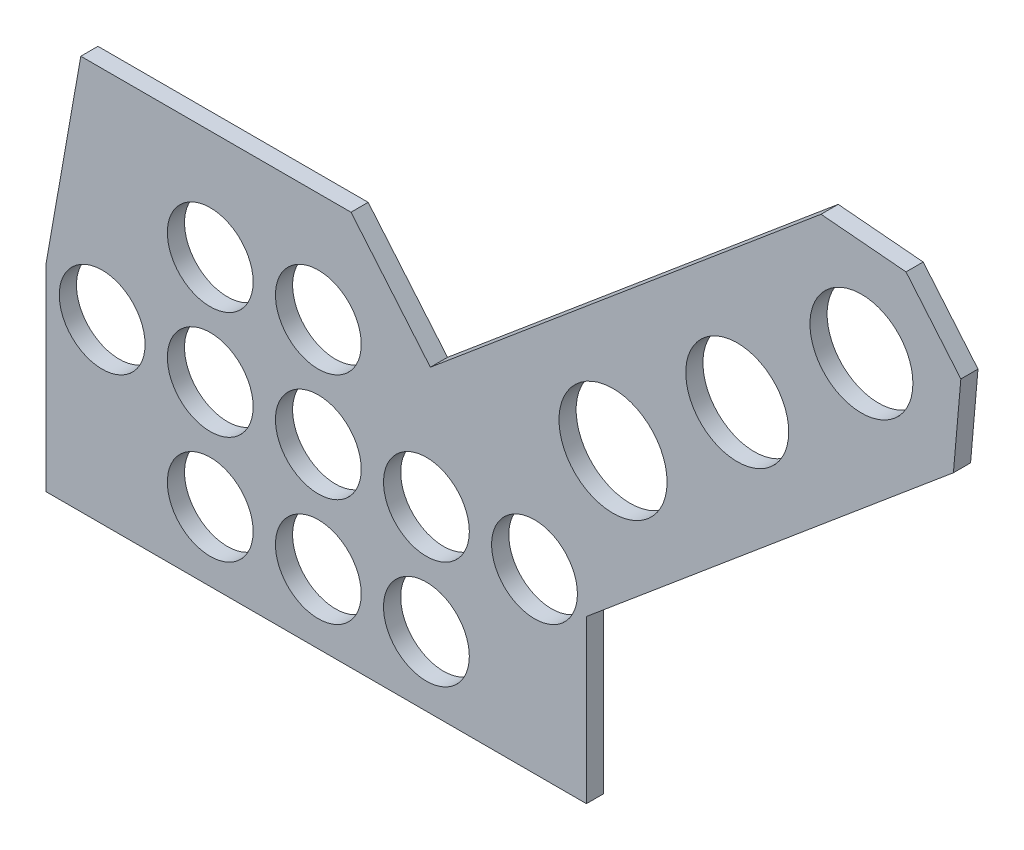
ISO-10303-21;
HEADER;
FILE_DESCRIPTION(('STEP AP214'),'2;1');
FILE_NAME('part.step','',(''),(''),'','','');
FILE_SCHEMA(('AUTOMOTIVE_DESIGN { 1 0 10303 214 1 1 1 1 }'));
ENDSEC;
DATA;
#1=APPLICATION_CONTEXT('core data for automotive mechanical design processes');
#2=APPLICATION_PROTOCOL_DEFINITION('international standard','automotive_design',2000,#1);
#3=PRODUCT_CONTEXT('',#1,'mechanical');
#4=PRODUCT('Part','Part','',(#3));
#5=PRODUCT_RELATED_PRODUCT_CATEGORY('part','',(#4));
#6=PRODUCT_DEFINITION_FORMATION('','',#4);
#7=PRODUCT_DEFINITION_CONTEXT('part definition',#1,'design');
#8=PRODUCT_DEFINITION('design','',#6,#7);
#9=PRODUCT_DEFINITION_SHAPE('','',#8);
#10=(LENGTH_UNIT() NAMED_UNIT(*) SI_UNIT(.MILLI.,.METRE.));
#11=(NAMED_UNIT(*) PLANE_ANGLE_UNIT() SI_UNIT($,.RADIAN.));
#12=(NAMED_UNIT(*) SI_UNIT($,.STERADIAN.) SOLID_ANGLE_UNIT());
#13=UNCERTAINTY_MEASURE_WITH_UNIT(LENGTH_MEASURE(1.E-05),#10,'distance_accuracy_value','');
#14=(GEOMETRIC_REPRESENTATION_CONTEXT(3) GLOBAL_UNCERTAINTY_ASSIGNED_CONTEXT((#13)) GLOBAL_UNIT_ASSIGNED_CONTEXT((#10,
#11,#12)) REPRESENTATION_CONTEXT('',''));
#15=CARTESIAN_POINT('',(0.,0.,0.));
#16=DIRECTION('',(0.,0.,1.));
#17=DIRECTION('',(1.,0.,0.));
#18=AXIS2_PLACEMENT_3D('',#15,#16,#17);
#19=CARTESIAN_POINT('',(56.435934795859,73.,3.175));
#20=DIRECTION('',(0.766044443118981,0.642787609686536,0.));
#21=DIRECTION('',(-0.642787609686536,0.766044443118981,0.));
#22=AXIS2_PLACEMENT_3D('',#19,#20,#21);
#23=PLANE('',#22);
#24=DIRECTION('',(0.642787609686536,-0.766044443118981,0.));
#25=VECTOR('',#24,1.);
#26=CARTESIAN_POINT('',(56.435934795859,73.,0.));
#27=LINE('',#26,#25);
#28=CARTESIAN_POINT('',(56.435934795859,73.,0.));
#29=VERTEX_POINT('',#28);
#30=CARTESIAN_POINT('',(71.1187158914035,55.5017428801103,0.));
#31=VERTEX_POINT('',#30);
#32=EDGE_CURVE('E152',#29,#31,#27,.T.);
#33=ORIENTED_EDGE('',*,*,#32,.F.);
#34=DIRECTION('',(0.,0.,-1.));
#35=VECTOR('',#34,1.);
#36=CARTESIAN_POINT('',(56.435934795859,73.,3.175));
#37=LINE('',#36,#35);
#38=CARTESIAN_POINT('',(56.435934795859,73.,3.175));
#39=VERTEX_POINT('',#38);
#40=EDGE_CURVE('E11',#39,#29,#37,.T.);
#41=ORIENTED_EDGE('',*,*,#40,.F.);
#42=DIRECTION('',(0.642787609686536,-0.766044443118981,0.));
#43=VECTOR('',#42,1.);
#44=CARTESIAN_POINT('',(56.435934795859,73.,3.175));
#45=LINE('',#44,#43);
#46=CARTESIAN_POINT('',(71.1187158914035,55.5017428801103,3.175));
#47=VERTEX_POINT('',#46);
#48=EDGE_CURVE('E175',#39,#47,#45,.T.);
#49=ORIENTED_EDGE('',*,*,#48,.T.);
#50=DIRECTION('',(0.,0.,-1.));
#51=VECTOR('',#50,1.);
#52=CARTESIAN_POINT('',(71.1187158914035,55.5017428801103,3.175));
#53=LINE('',#52,#51);
#54=EDGE_CURVE('E39',#47,#31,#53,.T.);
#55=ORIENTED_EDGE('',*,*,#54,.T.);
#56=EDGE_LOOP('',(#33,#41,#49,#55));
#57=FACE_BOUND('',#56,.T.);
#58=ADVANCED_FACE('F36',(#57),#23,.T.);
#59=CARTESIAN_POINT('',(56.435934795859,73.,3.175));
#60=DIRECTION('',(0.,-1.,0.));
#61=DIRECTION('',(1.,0.,0.));
#62=AXIS2_PLACEMENT_3D('',#59,#60,#61);
#63=PLANE('',#62);
#64=DIRECTION('',(-1.,0.,0.));
#65=VECTOR('',#64,1.);
#66=CARTESIAN_POINT('',(56.435934795859,73.,0.));
#67=LINE('',#66,#65);
#68=CARTESIAN_POINT('',(6.43593479585899,73.,0.));
#69=VERTEX_POINT('',#68);
#70=EDGE_CURVE('E90',#29,#69,#67,.T.);
#71=ORIENTED_EDGE('',*,*,#70,.T.);
#72=DIRECTION('',(0.,0.,-1.));
#73=VECTOR('',#72,1.);
#74=CARTESIAN_POINT('',(6.43593479585899,73.,3.175));
#75=LINE('',#74,#73);
#76=CARTESIAN_POINT('',(6.43593479585899,73.,3.175));
#77=VERTEX_POINT('',#76);
#78=EDGE_CURVE('E45',#77,#69,#75,.T.);
#79=ORIENTED_EDGE('',*,*,#78,.F.);
#80=DIRECTION('',(-1.,0.,0.));
#81=VECTOR('',#80,1.);
#82=CARTESIAN_POINT('',(56.435934795859,73.,3.175));
#83=LINE('',#82,#81);
#84=EDGE_CURVE('E130',#39,#77,#83,.T.);
#85=ORIENTED_EDGE('',*,*,#84,.F.);
#86=ORIENTED_EDGE('',*,*,#40,.T.);
#87=EDGE_LOOP('',(#71,#79,#85,#86));
#88=FACE_BOUND('',#87,.T.);
#89=ADVANCED_FACE('F356',(#88),#63,.F.);
#90=CARTESIAN_POINT('',(6.43593479585899,73.,3.175));
#91=DIRECTION('',(0.984807753012208,-0.173648177666931,0.));
#92=DIRECTION('',(0.173648177666931,0.984807753012208,0.));
#93=AXIS2_PLACEMENT_3D('',#90,#91,#92);
#94=PLANE('',#93);
#95=DIRECTION('',(-0.173648177666931,-0.984807753012208,0.));
#96=VECTOR('',#95,1.);
#97=CARTESIAN_POINT('',(6.43593479585899,73.,0.));
#98=LINE('',#97,#96);
#99=CARTESIAN_POINT('',(0.,36.5,0.));
#100=VERTEX_POINT('',#99);
#101=EDGE_CURVE('E137',#69,#100,#98,.T.);
#102=ORIENTED_EDGE('',*,*,#101,.T.);
#103=DIRECTION('',(0.,0.,-1.));
#104=VECTOR('',#103,1.);
#105=CARTESIAN_POINT('',(0.,36.5,3.175));
#106=LINE('',#105,#104);
#107=CARTESIAN_POINT('',(0.,36.5,3.175));
#108=VERTEX_POINT('',#107);
#109=EDGE_CURVE('E134',#108,#100,#106,.T.);
#110=ORIENTED_EDGE('',*,*,#109,.F.);
#111=DIRECTION('',(-0.173648177666931,-0.984807753012208,0.));
#112=VECTOR('',#111,1.);
#113=CARTESIAN_POINT('',(6.43593479585899,73.,3.175));
#114=LINE('',#113,#112);
#115=EDGE_CURVE('E123',#77,#108,#114,.T.);
#116=ORIENTED_EDGE('',*,*,#115,.F.);
#117=ORIENTED_EDGE('',*,*,#78,.T.);
#118=EDGE_LOOP('',(#102,#110,#116,#117));
#119=FACE_BOUND('',#118,.T.);
#120=ADVANCED_FACE('F135',(#119),#94,.F.);
#121=CARTESIAN_POINT('',(0.,36.5,3.175));
#122=DIRECTION('',(1.,0.,0.));
#123=DIRECTION('',(0.,1.,0.));
#124=AXIS2_PLACEMENT_3D('',#121,#122,#123);
#125=PLANE('',#124);
#126=DIRECTION('',(0.,-1.,0.));
#127=VECTOR('',#126,1.);
#128=CARTESIAN_POINT('',(0.,36.5,0.));
#129=LINE('',#128,#127);
#130=CARTESIAN_POINT('',(0.,0.,0.));
#131=VERTEX_POINT('',#130);
#132=EDGE_CURVE('E172',#100,#131,#129,.T.);
#133=ORIENTED_EDGE('',*,*,#132,.T.);
#134=DIRECTION('',(0.,0.,-1.));
#135=VECTOR('',#134,1.);
#136=CARTESIAN_POINT('',(0.,0.,3.175));
#137=LINE('',#136,#135);
#138=CARTESIAN_POINT('',(0.,0.,3.175));
#139=VERTEX_POINT('',#138);
#140=EDGE_CURVE('E140',#139,#131,#137,.T.);
#141=ORIENTED_EDGE('',*,*,#140,.F.);
#142=DIRECTION('',(0.,-1.,0.));
#143=VECTOR('',#142,1.);
#144=CARTESIAN_POINT('',(0.,36.5,3.175));
#145=LINE('',#144,#143);
#146=EDGE_CURVE('E128',#108,#139,#145,.T.);
#147=ORIENTED_EDGE('',*,*,#146,.F.);
#148=ORIENTED_EDGE('',*,*,#109,.T.);
#149=EDGE_LOOP('',(#133,#141,#147,#148));
#150=FACE_BOUND('',#149,.T.);
#151=ADVANCED_FACE('F142',(#150),#125,.F.);
#152=CARTESIAN_POINT('',(0.,0.,3.175));
#153=DIRECTION('',(0.,1.,0.));
#154=DIRECTION('',(0.,0.,1.));
#155=AXIS2_PLACEMENT_3D('',#152,#153,#154);
#156=PLANE('',#155);
#157=DIRECTION('',(1.,0.,0.));
#158=VECTOR('',#157,1.);
#159=CARTESIAN_POINT('',(0.,0.,0.));
#160=LINE('',#159,#158);
#161=CARTESIAN_POINT('',(100.,0.,0.));
#162=VERTEX_POINT('',#161);
#163=EDGE_CURVE('E170',#131,#162,#160,.T.);
#164=ORIENTED_EDGE('',*,*,#163,.T.);
#165=DIRECTION('',(0.,0.,-1.));
#166=VECTOR('',#165,1.);
#167=CARTESIAN_POINT('',(100.,0.,3.175));
#168=LINE('',#167,#166);
#169=CARTESIAN_POINT('',(100.,0.,3.175));
#170=VERTEX_POINT('',#169);
#171=EDGE_CURVE('E179',#170,#162,#168,.T.);
#172=ORIENTED_EDGE('',*,*,#171,.F.);
#173=DIRECTION('',(1.,0.,0.));
#174=VECTOR('',#173,1.);
#175=CARTESIAN_POINT('',(0.,0.,3.175));
#176=LINE('',#175,#174);
#177=EDGE_CURVE('E145',#139,#170,#176,.T.);
#178=ORIENTED_EDGE('',*,*,#177,.F.);
#179=ORIENTED_EDGE('',*,*,#140,.T.);
#180=EDGE_LOOP('',(#164,#172,#178,#179));
#181=FACE_BOUND('',#180,.T.);
#182=ADVANCED_FACE('F202',(#181),#156,.F.);
#183=CARTESIAN_POINT('',(100.,0.,3.175));
#184=DIRECTION('',(-1.,0.,0.));
#185=DIRECTION('',(0.,-1.,0.));
#186=AXIS2_PLACEMENT_3D('',#183,#184,#185);
#187=PLANE('',#186);
#188=DIRECTION('',(0.,1.,0.));
#189=VECTOR('',#188,1.);
#190=CARTESIAN_POINT('',(100.,0.,0.));
#191=LINE('',#190,#189);
#192=CARTESIAN_POINT('',(100.,30.,0.));
#193=VERTEX_POINT('',#192);
#194=EDGE_CURVE('E168',#162,#193,#191,.T.);
#195=ORIENTED_EDGE('',*,*,#194,.T.);
#196=DIRECTION('',(0.,0.,-1.));
#197=VECTOR('',#196,1.);
#198=CARTESIAN_POINT('',(100.,30.,3.175));
#199=LINE('',#198,#197);
#200=CARTESIAN_POINT('',(100.,30.,3.175));
#201=VERTEX_POINT('',#200);
#202=EDGE_CURVE('E182',#201,#193,#199,.T.);
#203=ORIENTED_EDGE('',*,*,#202,.F.);
#204=DIRECTION('',(0.,1.,0.));
#205=VECTOR('',#204,1.);
#206=CARTESIAN_POINT('',(100.,0.,3.175));
#207=LINE('',#206,#205);
#208=EDGE_CURVE('E147',#170,#201,#207,.T.);
#209=ORIENTED_EDGE('',*,*,#208,.F.);
#210=ORIENTED_EDGE('',*,*,#171,.T.);
#211=EDGE_LOOP('',(#195,#203,#209,#210));
#212=FACE_BOUND('',#211,.T.);
#213=ADVANCED_FACE('F210',(#212),#187,.F.);
#214=CARTESIAN_POINT('',(100.,30.,3.175));
#215=DIRECTION('',(-0.642787609686536,0.76604444311898,0.));
#216=DIRECTION('',(-0.766044443118981,-0.642787609686536,0.));
#217=AXIS2_PLACEMENT_3D('',#214,#215,#216);
#218=PLANE('',#217);
#219=DIRECTION('',(0.766044443118981,0.642787609686536,0.));
#220=VECTOR('',#219,1.);
#221=CARTESIAN_POINT('',(100.,30.,0.));
#222=LINE('',#221,#220);
#223=CARTESIAN_POINT('',(167.901300028348,86.9759558102443,0.));
#224=VERTEX_POINT('',#223);
#225=EDGE_CURVE('E166',#193,#224,#222,.T.);
#226=ORIENTED_EDGE('',*,*,#225,.T.);
#227=DIRECTION('',(0.,0.,-1.));
#228=VECTOR('',#227,1.);
#229=CARTESIAN_POINT('',(167.901300028348,86.9759558102443,3.175));
#230=LINE('',#229,#228);
#231=CARTESIAN_POINT('',(167.901300028348,86.9759558102443,3.175));
#232=VERTEX_POINT('',#231);
#233=EDGE_CURVE('E185',#232,#224,#230,.T.);
#234=ORIENTED_EDGE('',*,*,#233,.F.);
#235=DIRECTION('',(0.766044443118981,0.642787609686536,0.));
#236=VECTOR('',#235,1.);
#237=CARTESIAN_POINT('',(100.,30.,3.175));
#238=LINE('',#237,#236);
#239=EDGE_CURVE('E207',#201,#232,#238,.T.);
#240=ORIENTED_EDGE('',*,*,#239,.F.);
#241=ORIENTED_EDGE('',*,*,#202,.T.);
#242=EDGE_LOOP('',(#226,#234,#240,#241));
#243=FACE_BOUND('',#242,.T.);
#244=ADVANCED_FACE('F213',(#243),#218,.F.);
#245=CARTESIAN_POINT('',(167.901300028348,86.9759558102443,3.175));
#246=DIRECTION('',(-0.996194698091745,0.0871557427476636,0.));
#247=DIRECTION('',(-0.0871557427476636,-0.996194698091745,0.));
#248=AXIS2_PLACEMENT_3D('',#245,#246,#247);
#249=PLANE('',#248);
#250=DIRECTION('',(0.0871557427476636,0.996194698091745,0.));
#251=VECTOR('',#250,1.);
#252=CARTESIAN_POINT('',(167.901300028348,86.9759558102443,0.));
#253=LINE('',#252,#251);
#254=CARTESIAN_POINT('',(169.276751583438,102.697439024839,0.));
#255=VERTEX_POINT('',#254);
#256=EDGE_CURVE('E164',#224,#255,#253,.T.);
#257=ORIENTED_EDGE('',*,*,#256,.T.);
#258=DIRECTION('',(0.,0.,-1.));
#259=VECTOR('',#258,1.);
#260=CARTESIAN_POINT('',(169.276751583438,102.697439024839,3.175));
#261=LINE('',#260,#259);
#262=CARTESIAN_POINT('',(169.276751583438,102.697439024839,3.175));
#263=VERTEX_POINT('',#262);
#264=EDGE_CURVE('E188',#263,#255,#261,.T.);
#265=ORIENTED_EDGE('',*,*,#264,.F.);
#266=DIRECTION('',(0.0871557427476636,0.996194698091745,0.));
#267=VECTOR('',#266,1.);
#268=CARTESIAN_POINT('',(167.901300028348,86.9759558102443,3.175));
#269=LINE('',#268,#267);
#270=EDGE_CURVE('E215',#232,#263,#269,.T.);
#271=ORIENTED_EDGE('',*,*,#270,.F.);
#272=ORIENTED_EDGE('',*,*,#233,.T.);
#273=EDGE_LOOP('',(#257,#265,#271,#272));
#274=FACE_BOUND('',#273,.T.);
#275=ADVANCED_FACE('F374',(#274),#249,.F.);
#276=CARTESIAN_POINT('',(169.276751583438,102.697439024839,3.175));
#277=DIRECTION('',(-0.766044443118978,-0.642787609686539,0.));
#278=DIRECTION('',(0.642787609686539,-0.766044443118978,0.));
#279=AXIS2_PLACEMENT_3D('',#276,#277,#278);
#280=PLANE('',#279);
#281=DIRECTION('',(-0.642787609686539,0.766044443118978,0.));
#282=VECTOR('',#281,1.);
#283=CARTESIAN_POINT('',(169.276751583438,102.697439024839,0.));
#284=LINE('',#283,#282);
#285=CARTESIAN_POINT('',(159.132575313886,114.786797537987,0.));
#286=VERTEX_POINT('',#285);
#287=EDGE_CURVE('E162',#255,#286,#284,.T.);
#288=ORIENTED_EDGE('',*,*,#287,.T.);
#289=DIRECTION('',(0.,0.,-1.));
#290=VECTOR('',#289,1.);
#291=CARTESIAN_POINT('',(159.132575313886,114.786797537987,3.175));
#292=LINE('',#291,#290);
#293=CARTESIAN_POINT('',(159.132575313886,114.786797537987,3.175));
#294=VERTEX_POINT('',#293);
#295=EDGE_CURVE('E191',#294,#286,#292,.T.);
#296=ORIENTED_EDGE('',*,*,#295,.F.);
#297=DIRECTION('',(-0.642787609686539,0.766044443118978,0.));
#298=VECTOR('',#297,1.);
#299=CARTESIAN_POINT('',(169.276751583438,102.697439024839,3.175));
#300=LINE('',#299,#298);
#301=EDGE_CURVE('E217',#263,#294,#300,.T.);
#302=ORIENTED_EDGE('',*,*,#301,.F.);
#303=ORIENTED_EDGE('',*,*,#264,.T.);
#304=EDGE_LOOP('',(#288,#296,#302,#303));
#305=FACE_BOUND('',#304,.T.);
#306=ADVANCED_FACE('F377',(#305),#280,.F.);
#307=CARTESIAN_POINT('',(159.132575313886,114.786797537987,3.175));
#308=DIRECTION('',(-0.0871557427476628,-0.996194698091745,0.));
#309=DIRECTION('',(0.996194698091745,-0.0871557427476628,0.));
#310=AXIS2_PLACEMENT_3D('',#307,#308,#309);
#311=PLANE('',#310);
#312=DIRECTION('',(-0.996194698091745,0.0871557427476628,0.));
#313=VECTOR('',#312,1.);
#314=CARTESIAN_POINT('',(159.132575313886,114.786797537987,0.));
#315=LINE('',#314,#313);
#316=CARTESIAN_POINT('',(143.411092099291,116.162249093077,0.));
#317=VERTEX_POINT('',#316);
#318=EDGE_CURVE('E159',#286,#317,#315,.T.);
#319=ORIENTED_EDGE('',*,*,#318,.T.);
#320=DIRECTION('',(0.,0.,-1.));
#321=VECTOR('',#320,1.);
#322=CARTESIAN_POINT('',(143.411092099291,116.162249093077,3.175));
#323=LINE('',#322,#321);
#324=CARTESIAN_POINT('',(143.411092099291,116.162249093077,3.175));
#325=VERTEX_POINT('',#324);
#326=EDGE_CURVE('E193',#325,#317,#323,.T.);
#327=ORIENTED_EDGE('',*,*,#326,.F.);
#328=DIRECTION('',(-0.996194698091745,0.0871557427476628,0.));
#329=VECTOR('',#328,1.);
#330=CARTESIAN_POINT('',(159.132575313886,114.786797537987,3.175));
#331=LINE('',#330,#329);
#332=EDGE_CURVE('E221',#294,#325,#331,.T.);
#333=ORIENTED_EDGE('',*,*,#332,.F.);
#334=ORIENTED_EDGE('',*,*,#295,.T.);
#335=EDGE_LOOP('',(#319,#327,#333,#334));
#336=FACE_BOUND('',#335,.T.);
#337=ADVANCED_FACE('F381',(#336),#311,.F.);
#338=CARTESIAN_POINT('',(71.1187158914035,55.5017428801103,3.175));
#339=DIRECTION('',(-0.642787609686536,0.766044443118981,0.));
#340=DIRECTION('',(-0.766044443118981,-0.642787609686536,0.));
#341=AXIS2_PLACEMENT_3D('',#338,#339,#340);
#342=PLANE('',#341);
#343=DIRECTION('',(0.766044443118981,0.642787609686536,0.));
#344=VECTOR('',#343,1.);
#345=CARTESIAN_POINT('',(71.1187158914035,55.5017428801103,0.));
#346=LINE('',#345,#344);
#347=EDGE_CURVE('E155',#31,#317,#346,.T.);
#348=ORIENTED_EDGE('',*,*,#347,.F.);
#349=ORIENTED_EDGE('',*,*,#54,.F.);
#350=DIRECTION('',(0.766044443118981,0.642787609686536,0.));
#351=VECTOR('',#350,1.);
#352=CARTESIAN_POINT('',(71.1187158914035,55.5017428801103,3.175));
#353=LINE('',#352,#351);
#354=EDGE_CURVE('E223',#47,#325,#353,.T.);
#355=ORIENTED_EDGE('',*,*,#354,.T.);
#356=ORIENTED_EDGE('',*,*,#326,.T.);
#357=EDGE_LOOP('',(#348,#349,#355,#356));
#358=FACE_BOUND('',#357,.T.);
#359=ADVANCED_FACE('F195',(#358),#342,.T.);
#360=CARTESIAN_POINT('',(0.,0.,3.175));
#361=DIRECTION('',(0.,0.,1.));
#362=DIRECTION('',(1.,0.,0.));
#363=AXIS2_PLACEMENT_3D('',#360,#361,#362);
#364=PLANE('',#363);
#365=CARTESIAN_POINT('',(150.882386677049,97.563400755911,3.175));
#366=DIRECTION('',(0.,0.,1.));
#367=DIRECTION('',(1.,0.,0.));
#368=AXIS2_PLACEMENT_3D('',#365,#366,#367);
#369=CIRCLE('',#368,9.525);
#370=CARTESIAN_POINT('',(160.407386677049,97.563400755911,3.175));
#371=VERTEX_POINT('',#370);
#372=EDGE_CURVE('E275',#371,#371,#369,.T.);
#373=ORIENTED_EDGE('',*,*,#372,.F.);
#374=EDGE_LOOP('',(#373));
#375=FACE_BOUND('',#374,.T.);
#376=CARTESIAN_POINT('',(90.3915081100321,32.7666715774771,3.175));
#377=DIRECTION('',(0.,0.,1.));
#378=DIRECTION('',(1.,0.,0.));
#379=AXIS2_PLACEMENT_3D('',#376,#377,#378);
#380=CIRCLE('',#379,7.93749999999999);
#381=CARTESIAN_POINT('',(98.3290081100321,32.7666715774771,3.175));
#382=VERTEX_POINT('',#381);
#383=EDGE_CURVE('E279',#382,#382,#380,.T.);
#384=ORIENTED_EDGE('',*,*,#383,.F.);
#385=EDGE_LOOP('',(#384));
#386=FACE_BOUND('',#385,.T.);
#387=CARTESIAN_POINT('',(70.3915081100321,12.7666715774771,3.175));
#388=DIRECTION('',(0.,0.,1.));
#389=DIRECTION('',(1.,0.,0.));
#390=AXIS2_PLACEMENT_3D('',#387,#388,#389);
#391=CIRCLE('',#390,7.9375);
#392=CARTESIAN_POINT('',(78.3290081100321,12.7666715774771,3.175));
#393=VERTEX_POINT('',#392);
#394=EDGE_CURVE('E285',#393,#393,#391,.T.);
#395=ORIENTED_EDGE('',*,*,#394,.F.);
#396=EDGE_LOOP('',(#395));
#397=FACE_BOUND('',#396,.T.);
#398=CARTESIAN_POINT('',(50.3915081100321,12.7666715774771,3.175));
#399=DIRECTION('',(0.,0.,1.));
#400=DIRECTION('',(1.,0.,0.));
#401=AXIS2_PLACEMENT_3D('',#398,#399,#400);
#402=CIRCLE('',#401,7.9375);
#403=CARTESIAN_POINT('',(58.3290081100321,12.7666715774771,3.175));
#404=VERTEX_POINT('',#403);
#405=EDGE_CURVE('E291',#404,#404,#402,.T.);
#406=ORIENTED_EDGE('',*,*,#405,.F.);
#407=EDGE_LOOP('',(#406));
#408=FACE_BOUND('',#407,.T.);
#409=CARTESIAN_POINT('',(30.3915081100321,12.7666715774771,3.175));
#410=DIRECTION('',(0.,0.,1.));
#411=DIRECTION('',(1.,0.,0.));
#412=AXIS2_PLACEMENT_3D('',#409,#410,#411);
#413=CIRCLE('',#412,7.93750000000001);
#414=CARTESIAN_POINT('',(38.3290081100321,12.7666715774771,3.175));
#415=VERTEX_POINT('',#414);
#416=EDGE_CURVE('E230',#415,#415,#413,.T.);
#417=ORIENTED_EDGE('',*,*,#416,.F.);
#418=EDGE_LOOP('',(#417));
#419=FACE_BOUND('',#418,.T.);
#420=CARTESIAN_POINT('',(70.3915081100321,32.7666715774771,3.175));
#421=DIRECTION('',(0.,0.,1.));
#422=DIRECTION('',(1.,0.,0.));
#423=AXIS2_PLACEMENT_3D('',#420,#421,#422);
#424=CIRCLE('',#423,7.93749999999999);
#425=CARTESIAN_POINT('',(78.3290081100321,32.7666715774771,3.175));
#426=VERTEX_POINT('',#425);
#427=EDGE_CURVE('E229',#426,#426,#424,.T.);
#428=ORIENTED_EDGE('',*,*,#427,.F.);
#429=EDGE_LOOP('',(#428));
#430=FACE_BOUND('',#429,.T.);
#431=CARTESIAN_POINT('',(50.3915081100321,32.7666715774771,3.175));
#432=DIRECTION('',(0.,0.,1.));
#433=DIRECTION('',(1.,0.,0.));
#434=AXIS2_PLACEMENT_3D('',#431,#432,#433);
#435=CIRCLE('',#434,7.9375);
#436=CARTESIAN_POINT('',(58.3290081100321,32.7666715774771,3.175));
#437=VERTEX_POINT('',#436);
#438=EDGE_CURVE('E236',#437,#437,#435,.T.);
#439=ORIENTED_EDGE('',*,*,#438,.F.);
#440=EDGE_LOOP('',(#439));
#441=FACE_BOUND('',#440,.T.);
#442=CARTESIAN_POINT('',(30.3915081100321,32.7666715774771,3.175));
#443=DIRECTION('',(0.,0.,1.));
#444=DIRECTION('',(1.,0.,0.));
#445=AXIS2_PLACEMENT_3D('',#442,#443,#444);
#446=CIRCLE('',#445,7.93750000000001);
#447=CARTESIAN_POINT('',(38.3290081100321,32.7666715774771,3.175));
#448=VERTEX_POINT('',#447);
#449=EDGE_CURVE('E242',#448,#448,#446,.T.);
#450=ORIENTED_EDGE('',*,*,#449,.F.);
#451=EDGE_LOOP('',(#450));
#452=FACE_BOUND('',#451,.T.);
#453=CARTESIAN_POINT('',(10.3915081100321,32.7666715774771,3.175));
#454=DIRECTION('',(0.,0.,1.));
#455=DIRECTION('',(1.,0.,0.));
#456=AXIS2_PLACEMENT_3D('',#453,#454,#455);
#457=CIRCLE('',#456,7.9375);
#458=CARTESIAN_POINT('',(18.3290081100321,32.7666715774771,3.175));
#459=VERTEX_POINT('',#458);
#460=EDGE_CURVE('E248',#459,#459,#457,.T.);
#461=ORIENTED_EDGE('',*,*,#460,.F.);
#462=EDGE_LOOP('',(#461));
#463=FACE_BOUND('',#462,.T.);
#464=CARTESIAN_POINT('',(50.3915081100321,52.7666715774771,3.175));
#465=DIRECTION('',(0.,0.,1.));
#466=DIRECTION('',(1.,0.,0.));
#467=AXIS2_PLACEMENT_3D('',#464,#465,#466);
#468=CIRCLE('',#467,7.9375);
#469=CARTESIAN_POINT('',(58.3290081100321,52.7666715774771,3.175));
#470=VERTEX_POINT('',#469);
#471=EDGE_CURVE('E254',#470,#470,#468,.T.);
#472=ORIENTED_EDGE('',*,*,#471,.F.);
#473=EDGE_LOOP('',(#472));
#474=FACE_BOUND('',#473,.T.);
#475=CARTESIAN_POINT('',(30.3915081100321,52.7666715774771,3.175));
#476=DIRECTION('',(0.,0.,1.));
#477=DIRECTION('',(1.,0.,0.));
#478=AXIS2_PLACEMENT_3D('',#475,#476,#477);
#479=CIRCLE('',#478,7.93750000000001);
#480=CARTESIAN_POINT('',(38.3290081100321,52.7666715774771,3.175));
#481=VERTEX_POINT('',#480);
#482=EDGE_CURVE('E260',#481,#481,#479,.T.);
#483=ORIENTED_EDGE('',*,*,#482,.F.);
#484=EDGE_LOOP('',(#483));
#485=FACE_BOUND('',#484,.T.);
#486=CARTESIAN_POINT('',(104.91972008991,58.9961441747186,3.175));
#487=DIRECTION('',(0.,0.,1.));
#488=DIRECTION('',(1.,0.,0.));
#489=AXIS2_PLACEMENT_3D('',#486,#487,#488);
#490=CIRCLE('',#489,9.99999999999999);
#491=CARTESIAN_POINT('',(114.91972008991,58.9961441747186,3.175));
#492=VERTEX_POINT('',#491);
#493=EDGE_CURVE('E266',#492,#492,#490,.T.);
#494=ORIENTED_EDGE('',*,*,#493,.F.);
#495=EDGE_LOOP('',(#494));
#496=FACE_BOUND('',#495,.T.);
#497=CARTESIAN_POINT('',(127.90105338348,78.2797724653148,3.175));
#498=DIRECTION('',(0.,0.,1.));
#499=DIRECTION('',(1.,0.,0.));
#500=AXIS2_PLACEMENT_3D('',#497,#498,#499);
#501=CIRCLE('',#500,9.525);
#502=CARTESIAN_POINT('',(137.42605338348,78.2797724653148,3.175));
#503=VERTEX_POINT('',#502);
#504=EDGE_CURVE('E272',#503,#503,#501,.T.);
#505=ORIENTED_EDGE('',*,*,#504,.F.);
#506=EDGE_LOOP('',(#505));
#507=FACE_BOUND('',#506,.T.);
#508=ORIENTED_EDGE('',*,*,#48,.F.);
#509=ORIENTED_EDGE('',*,*,#84,.T.);
#510=ORIENTED_EDGE('',*,*,#115,.T.);
#511=ORIENTED_EDGE('',*,*,#146,.T.);
#512=ORIENTED_EDGE('',*,*,#177,.T.);
#513=ORIENTED_EDGE('',*,*,#208,.T.);
#514=ORIENTED_EDGE('',*,*,#239,.T.);
#515=ORIENTED_EDGE('',*,*,#270,.T.);
#516=ORIENTED_EDGE('',*,*,#301,.T.);
#517=ORIENTED_EDGE('',*,*,#332,.T.);
#518=ORIENTED_EDGE('',*,*,#354,.F.);
#519=EDGE_LOOP('',(#508,#509,#510,#511,#512,#513,#514,#515,#516,#517,#518));
#520=FACE_BOUND('',#519,.T.);
#521=ADVANCED_FACE('F126',(#375,#386,#397,#408,#419,#430,#441,#452,#463,#474,#485,#496,#507,
#520),#364,.T.);
#522=CARTESIAN_POINT('',(0.,0.,0.));
#523=DIRECTION('',(0.,0.,1.));
#524=DIRECTION('',(1.,0.,0.));
#525=AXIS2_PLACEMENT_3D('',#522,#523,#524);
#526=PLANE('',#525);
#527=CARTESIAN_POINT('',(150.882386677049,97.563400755911,0.));
#528=DIRECTION('',(0.,0.,1.));
#529=DIRECTION('',(1.,0.,0.));
#530=AXIS2_PLACEMENT_3D('',#527,#528,#529);
#531=CIRCLE('',#530,9.525);
#532=CARTESIAN_POINT('',(160.407386677049,97.563400755911,0.));
#533=VERTEX_POINT('',#532);
#534=EDGE_CURVE('E156',#533,#533,#531,.T.);
#535=ORIENTED_EDGE('',*,*,#534,.T.);
#536=EDGE_LOOP('',(#535));
#537=FACE_BOUND('',#536,.T.);
#538=CARTESIAN_POINT('',(90.3915081100321,32.7666715774771,0.));
#539=DIRECTION('',(0.,0.,1.));
#540=DIRECTION('',(1.,0.,0.));
#541=AXIS2_PLACEMENT_3D('',#538,#539,#540);
#542=CIRCLE('',#541,7.93749999999999);
#543=CARTESIAN_POINT('',(98.3290081100321,32.7666715774771,0.));
#544=VERTEX_POINT('',#543);
#545=EDGE_CURVE('E276',#544,#544,#542,.T.);
#546=ORIENTED_EDGE('',*,*,#545,.T.);
#547=EDGE_LOOP('',(#546));
#548=FACE_BOUND('',#547,.T.);
#549=CARTESIAN_POINT('',(70.3915081100321,12.7666715774771,0.));
#550=DIRECTION('',(0.,0.,1.));
#551=DIRECTION('',(1.,0.,0.));
#552=AXIS2_PLACEMENT_3D('',#549,#550,#551);
#553=CIRCLE('',#552,7.9375);
#554=CARTESIAN_POINT('',(78.3290081100321,12.7666715774771,0.));
#555=VERTEX_POINT('',#554);
#556=EDGE_CURVE('E282',#555,#555,#553,.T.);
#557=ORIENTED_EDGE('',*,*,#556,.T.);
#558=EDGE_LOOP('',(#557));
#559=FACE_BOUND('',#558,.T.);
#560=CARTESIAN_POINT('',(50.3915081100321,12.7666715774771,0.));
#561=DIRECTION('',(0.,0.,1.));
#562=DIRECTION('',(1.,0.,0.));
#563=AXIS2_PLACEMENT_3D('',#560,#561,#562);
#564=CIRCLE('',#563,7.9375);
#565=CARTESIAN_POINT('',(58.3290081100321,12.7666715774771,0.));
#566=VERTEX_POINT('',#565);
#567=EDGE_CURVE('E288',#566,#566,#564,.T.);
#568=ORIENTED_EDGE('',*,*,#567,.T.);
#569=EDGE_LOOP('',(#568));
#570=FACE_BOUND('',#569,.T.);
#571=CARTESIAN_POINT('',(30.3915081100321,12.7666715774771,0.));
#572=DIRECTION('',(0.,0.,1.));
#573=DIRECTION('',(1.,0.,0.));
#574=AXIS2_PLACEMENT_3D('',#571,#572,#573);
#575=CIRCLE('',#574,7.93750000000001);
#576=CARTESIAN_POINT('',(38.3290081100321,12.7666715774771,0.));
#577=VERTEX_POINT('',#576);
#578=EDGE_CURVE('E294',#577,#577,#575,.T.);
#579=ORIENTED_EDGE('',*,*,#578,.T.);
#580=EDGE_LOOP('',(#579));
#581=FACE_BOUND('',#580,.T.);
#582=CARTESIAN_POINT('',(70.3915081100321,32.7666715774771,0.));
#583=DIRECTION('',(0.,0.,1.));
#584=DIRECTION('',(1.,0.,0.));
#585=AXIS2_PLACEMENT_3D('',#582,#583,#584);
#586=CIRCLE('',#585,7.93749999999999);
#587=CARTESIAN_POINT('',(78.3290081100321,32.7666715774771,0.));
#588=VERTEX_POINT('',#587);
#589=EDGE_CURVE('E226',#588,#588,#586,.T.);
#590=ORIENTED_EDGE('',*,*,#589,.T.);
#591=EDGE_LOOP('',(#590));
#592=FACE_BOUND('',#591,.T.);
#593=CARTESIAN_POINT('',(50.3915081100321,32.7666715774771,0.));
#594=DIRECTION('',(0.,0.,1.));
#595=DIRECTION('',(1.,0.,0.));
#596=AXIS2_PLACEMENT_3D('',#593,#594,#595);
#597=CIRCLE('',#596,7.9375);
#598=CARTESIAN_POINT('',(58.3290081100321,32.7666715774771,0.));
#599=VERTEX_POINT('',#598);
#600=EDGE_CURVE('E233',#599,#599,#597,.T.);
#601=ORIENTED_EDGE('',*,*,#600,.T.);
#602=EDGE_LOOP('',(#601));
#603=FACE_BOUND('',#602,.T.);
#604=CARTESIAN_POINT('',(30.3915081100321,32.7666715774771,0.));
#605=DIRECTION('',(0.,0.,1.));
#606=DIRECTION('',(1.,0.,0.));
#607=AXIS2_PLACEMENT_3D('',#604,#605,#606);
#608=CIRCLE('',#607,7.93750000000001);
#609=CARTESIAN_POINT('',(38.3290081100321,32.7666715774771,0.));
#610=VERTEX_POINT('',#609);
#611=EDGE_CURVE('E239',#610,#610,#608,.T.);
#612=ORIENTED_EDGE('',*,*,#611,.T.);
#613=EDGE_LOOP('',(#612));
#614=FACE_BOUND('',#613,.T.);
#615=CARTESIAN_POINT('',(10.3915081100321,32.7666715774771,0.));
#616=DIRECTION('',(0.,0.,1.));
#617=DIRECTION('',(1.,0.,0.));
#618=AXIS2_PLACEMENT_3D('',#615,#616,#617);
#619=CIRCLE('',#618,7.9375);
#620=CARTESIAN_POINT('',(18.3290081100321,32.7666715774771,0.));
#621=VERTEX_POINT('',#620);
#622=EDGE_CURVE('E245',#621,#621,#619,.T.);
#623=ORIENTED_EDGE('',*,*,#622,.T.);
#624=EDGE_LOOP('',(#623));
#625=FACE_BOUND('',#624,.T.);
#626=CARTESIAN_POINT('',(50.3915081100321,52.7666715774771,0.));
#627=DIRECTION('',(0.,0.,1.));
#628=DIRECTION('',(1.,0.,0.));
#629=AXIS2_PLACEMENT_3D('',#626,#627,#628);
#630=CIRCLE('',#629,7.9375);
#631=CARTESIAN_POINT('',(58.3290081100321,52.7666715774771,0.));
#632=VERTEX_POINT('',#631);
#633=EDGE_CURVE('E251',#632,#632,#630,.T.);
#634=ORIENTED_EDGE('',*,*,#633,.T.);
#635=EDGE_LOOP('',(#634));
#636=FACE_BOUND('',#635,.T.);
#637=CARTESIAN_POINT('',(30.3915081100321,52.7666715774771,0.));
#638=DIRECTION('',(0.,0.,1.));
#639=DIRECTION('',(1.,0.,0.));
#640=AXIS2_PLACEMENT_3D('',#637,#638,#639);
#641=CIRCLE('',#640,7.93750000000001);
#642=CARTESIAN_POINT('',(38.3290081100321,52.7666715774771,0.));
#643=VERTEX_POINT('',#642);
#644=EDGE_CURVE('E257',#643,#643,#641,.T.);
#645=ORIENTED_EDGE('',*,*,#644,.T.);
#646=EDGE_LOOP('',(#645));
#647=FACE_BOUND('',#646,.T.);
#648=CARTESIAN_POINT('',(104.91972008991,58.9961441747186,0.));
#649=DIRECTION('',(0.,0.,1.));
#650=DIRECTION('',(1.,0.,0.));
#651=AXIS2_PLACEMENT_3D('',#648,#649,#650);
#652=CIRCLE('',#651,9.99999999999999);
#653=CARTESIAN_POINT('',(114.91972008991,58.9961441747186,0.));
#654=VERTEX_POINT('',#653);
#655=EDGE_CURVE('E263',#654,#654,#652,.T.);
#656=ORIENTED_EDGE('',*,*,#655,.T.);
#657=EDGE_LOOP('',(#656));
#658=FACE_BOUND('',#657,.T.);
#659=CARTESIAN_POINT('',(127.90105338348,78.2797724653148,0.));
#660=DIRECTION('',(0.,0.,1.));
#661=DIRECTION('',(1.,0.,0.));
#662=AXIS2_PLACEMENT_3D('',#659,#660,#661);
#663=CIRCLE('',#662,9.525);
#664=CARTESIAN_POINT('',(137.42605338348,78.2797724653148,0.));
#665=VERTEX_POINT('',#664);
#666=EDGE_CURVE('E269',#665,#665,#663,.T.);
#667=ORIENTED_EDGE('',*,*,#666,.T.);
#668=EDGE_LOOP('',(#667));
#669=FACE_BOUND('',#668,.T.);
#670=ORIENTED_EDGE('',*,*,#32,.T.);
#671=ORIENTED_EDGE('',*,*,#347,.T.);
#672=ORIENTED_EDGE('',*,*,#318,.F.);
#673=ORIENTED_EDGE('',*,*,#287,.F.);
#674=ORIENTED_EDGE('',*,*,#256,.F.);
#675=ORIENTED_EDGE('',*,*,#225,.F.);
#676=ORIENTED_EDGE('',*,*,#194,.F.);
#677=ORIENTED_EDGE('',*,*,#163,.F.);
#678=ORIENTED_EDGE('',*,*,#132,.F.);
#679=ORIENTED_EDGE('',*,*,#101,.F.);
#680=ORIENTED_EDGE('',*,*,#70,.F.);
#681=EDGE_LOOP('',(#670,#671,#672,#673,#674,#675,#676,#677,#678,#679,#680));
#682=FACE_BOUND('',#681,.T.);
#683=ADVANCED_FACE('F198',(#537,#548,#559,#570,#581,#592,#603,#614,#625,#636,#647,#658,#669,
#682),#526,.F.);
#684=CARTESIAN_POINT('',(127.90105338348,78.2797724653148,0.));
#685=DIRECTION('',(0.,0.,1.));
#686=DIRECTION('',(1.,0.,0.));
#687=AXIS2_PLACEMENT_3D('',#684,#685,#686);
#688=CYLINDRICAL_SURFACE('',#687,9.525);
#689=ORIENTED_EDGE('',*,*,#666,.F.);
#690=EDGE_LOOP('',(#689));
#691=FACE_BOUND('',#690,.T.);
#692=ORIENTED_EDGE('',*,*,#504,.T.);
#693=EDGE_LOOP('',(#692));
#694=FACE_BOUND('',#693,.T.);
#695=ADVANCED_FACE('F340',(#691,#694),#688,.F.);
#696=CARTESIAN_POINT('',(104.91972008991,58.9961441747186,0.));
#697=DIRECTION('',(0.,0.,1.));
#698=DIRECTION('',(1.,0.,0.));
#699=AXIS2_PLACEMENT_3D('',#696,#697,#698);
#700=CYLINDRICAL_SURFACE('',#699,9.99999999999999);
#701=ORIENTED_EDGE('',*,*,#655,.F.);
#702=EDGE_LOOP('',(#701));
#703=FACE_BOUND('',#702,.T.);
#704=ORIENTED_EDGE('',*,*,#493,.T.);
#705=EDGE_LOOP('',(#704));
#706=FACE_BOUND('',#705,.T.);
#707=ADVANCED_FACE('F342',(#703,#706),#700,.F.);
#708=CARTESIAN_POINT('',(30.3915081100321,52.7666715774771,0.));
#709=DIRECTION('',(0.,0.,1.));
#710=DIRECTION('',(1.,0.,0.));
#711=AXIS2_PLACEMENT_3D('',#708,#709,#710);
#712=CYLINDRICAL_SURFACE('',#711,7.93750000000001);
#713=ORIENTED_EDGE('',*,*,#644,.F.);
#714=EDGE_LOOP('',(#713));
#715=FACE_BOUND('',#714,.T.);
#716=ORIENTED_EDGE('',*,*,#482,.T.);
#717=EDGE_LOOP('',(#716));
#718=FACE_BOUND('',#717,.T.);
#719=ADVANCED_FACE('F349',(#715,#718),#712,.F.);
#720=CARTESIAN_POINT('',(50.3915081100321,52.7666715774771,0.));
#721=DIRECTION('',(0.,0.,1.));
#722=DIRECTION('',(1.,0.,0.));
#723=AXIS2_PLACEMENT_3D('',#720,#721,#722);
#724=CYLINDRICAL_SURFACE('',#723,7.9375);
#725=ORIENTED_EDGE('',*,*,#633,.F.);
#726=EDGE_LOOP('',(#725));
#727=FACE_BOUND('',#726,.T.);
#728=ORIENTED_EDGE('',*,*,#471,.T.);
#729=EDGE_LOOP('',(#728));
#730=FACE_BOUND('',#729,.T.);
#731=ADVANCED_FACE('F420',(#727,#730),#724,.F.);
#732=CARTESIAN_POINT('',(10.3915081100321,32.7666715774771,0.));
#733=DIRECTION('',(0.,0.,1.));
#734=DIRECTION('',(1.,0.,0.));
#735=AXIS2_PLACEMENT_3D('',#732,#733,#734);
#736=CYLINDRICAL_SURFACE('',#735,7.9375);
#737=ORIENTED_EDGE('',*,*,#622,.F.);
#738=EDGE_LOOP('',(#737));
#739=FACE_BOUND('',#738,.T.);
#740=ORIENTED_EDGE('',*,*,#460,.T.);
#741=EDGE_LOOP('',(#740));
#742=FACE_BOUND('',#741,.T.);
#743=ADVANCED_FACE('F431',(#739,#742),#736,.F.);
#744=CARTESIAN_POINT('',(30.3915081100321,32.7666715774771,0.));
#745=DIRECTION('',(0.,0.,1.));
#746=DIRECTION('',(1.,0.,0.));
#747=AXIS2_PLACEMENT_3D('',#744,#745,#746);
#748=CYLINDRICAL_SURFACE('',#747,7.93750000000001);
#749=ORIENTED_EDGE('',*,*,#611,.F.);
#750=EDGE_LOOP('',(#749));
#751=FACE_BOUND('',#750,.T.);
#752=ORIENTED_EDGE('',*,*,#449,.T.);
#753=EDGE_LOOP('',(#752));
#754=FACE_BOUND('',#753,.T.);
#755=ADVANCED_FACE('F442',(#751,#754),#748,.F.);
#756=CARTESIAN_POINT('',(50.3915081100321,32.7666715774771,0.));
#757=DIRECTION('',(0.,0.,1.));
#758=DIRECTION('',(1.,0.,0.));
#759=AXIS2_PLACEMENT_3D('',#756,#757,#758);
#760=CYLINDRICAL_SURFACE('',#759,7.9375);
#761=ORIENTED_EDGE('',*,*,#600,.F.);
#762=EDGE_LOOP('',(#761));
#763=FACE_BOUND('',#762,.T.);
#764=ORIENTED_EDGE('',*,*,#438,.T.);
#765=EDGE_LOOP('',(#764));
#766=FACE_BOUND('',#765,.T.);
#767=ADVANCED_FACE('F453',(#763,#766),#760,.F.);
#768=CARTESIAN_POINT('',(70.3915081100321,32.7666715774771,0.));
#769=DIRECTION('',(0.,0.,1.));
#770=DIRECTION('',(1.,0.,0.));
#771=AXIS2_PLACEMENT_3D('',#768,#769,#770);
#772=CYLINDRICAL_SURFACE('',#771,7.93749999999999);
#773=ORIENTED_EDGE('',*,*,#589,.F.);
#774=EDGE_LOOP('',(#773));
#775=FACE_BOUND('',#774,.T.);
#776=ORIENTED_EDGE('',*,*,#427,.T.);
#777=EDGE_LOOP('',(#776));
#778=FACE_BOUND('',#777,.T.);
#779=ADVANCED_FACE('F464',(#775,#778),#772,.F.);
#780=CARTESIAN_POINT('',(30.3915081100321,12.7666715774771,0.));
#781=DIRECTION('',(0.,0.,1.));
#782=DIRECTION('',(1.,0.,0.));
#783=AXIS2_PLACEMENT_3D('',#780,#781,#782);
#784=CYLINDRICAL_SURFACE('',#783,7.93750000000001);
#785=ORIENTED_EDGE('',*,*,#578,.F.);
#786=EDGE_LOOP('',(#785));
#787=FACE_BOUND('',#786,.T.);
#788=ORIENTED_EDGE('',*,*,#416,.T.);
#789=EDGE_LOOP('',(#788));
#790=FACE_BOUND('',#789,.T.);
#791=ADVANCED_FACE('F475',(#787,#790),#784,.F.);
#792=CARTESIAN_POINT('',(50.3915081100321,12.7666715774771,0.));
#793=DIRECTION('',(0.,0.,1.));
#794=DIRECTION('',(1.,0.,0.));
#795=AXIS2_PLACEMENT_3D('',#792,#793,#794);
#796=CYLINDRICAL_SURFACE('',#795,7.9375);
#797=ORIENTED_EDGE('',*,*,#567,.F.);
#798=EDGE_LOOP('',(#797));
#799=FACE_BOUND('',#798,.T.);
#800=ORIENTED_EDGE('',*,*,#405,.T.);
#801=EDGE_LOOP('',(#800));
#802=FACE_BOUND('',#801,.T.);
#803=ADVANCED_FACE('F486',(#799,#802),#796,.F.);
#804=CARTESIAN_POINT('',(70.3915081100321,12.7666715774771,0.));
#805=DIRECTION('',(0.,0.,1.));
#806=DIRECTION('',(1.,0.,0.));
#807=AXIS2_PLACEMENT_3D('',#804,#805,#806);
#808=CYLINDRICAL_SURFACE('',#807,7.9375);
#809=ORIENTED_EDGE('',*,*,#556,.F.);
#810=EDGE_LOOP('',(#809));
#811=FACE_BOUND('',#810,.T.);
#812=ORIENTED_EDGE('',*,*,#394,.T.);
#813=EDGE_LOOP('',(#812));
#814=FACE_BOUND('',#813,.T.);
#815=ADVANCED_FACE('F497',(#811,#814),#808,.F.);
#816=CARTESIAN_POINT('',(90.3915081100321,32.7666715774771,0.));
#817=DIRECTION('',(0.,0.,1.));
#818=DIRECTION('',(1.,0.,0.));
#819=AXIS2_PLACEMENT_3D('',#816,#817,#818);
#820=CYLINDRICAL_SURFACE('',#819,7.93749999999999);
#821=ORIENTED_EDGE('',*,*,#545,.F.);
#822=EDGE_LOOP('',(#821));
#823=FACE_BOUND('',#822,.T.);
#824=ORIENTED_EDGE('',*,*,#383,.T.);
#825=EDGE_LOOP('',(#824));
#826=FACE_BOUND('',#825,.T.);
#827=ADVANCED_FACE('F309',(#823,#826),#820,.F.);
#828=CARTESIAN_POINT('',(150.882386677049,97.563400755911,0.));
#829=DIRECTION('',(0.,0.,1.));
#830=DIRECTION('',(1.,0.,0.));
#831=AXIS2_PLACEMENT_3D('',#828,#829,#830);
#832=CYLINDRICAL_SURFACE('',#831,9.525);
#833=ORIENTED_EDGE('',*,*,#534,.F.);
#834=EDGE_LOOP('',(#833));
#835=FACE_BOUND('',#834,.T.);
#836=ORIENTED_EDGE('',*,*,#372,.T.);
#837=EDGE_LOOP('',(#836));
#838=FACE_BOUND('',#837,.T.);
#839=ADVANCED_FACE('F306',(#835,#838),#832,.F.);
#840=CLOSED_SHELL('',(#58,#89,#120,#151,#182,#213,#244,#275,#306,#337,#359,#521,#683,#695,#707,
#719,#731,#743,#755,#767,#779,#791,#803,#815,#827,#839));
#841=MANIFOLD_SOLID_BREP('B2',#840);
#842=ADVANCED_BREP_SHAPE_REPRESENTATION('',(#18,#841),#14);
#843=SHAPE_DEFINITION_REPRESENTATION(#9,#842);
ENDSEC;
END-ISO-10303-21;
